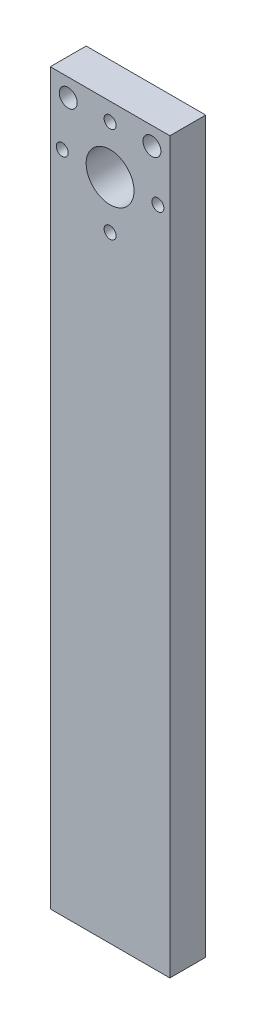
ISO-10303-21;
HEADER;
FILE_DESCRIPTION(('STEP AP214'),'2;1');
FILE_NAME('part.step','',(''),(''),'','','');
FILE_SCHEMA(('AUTOMOTIVE_DESIGN { 1 0 10303 214 1 1 1 1 }'));
ENDSEC;
DATA;
#1=APPLICATION_CONTEXT('core data for automotive mechanical design processes');
#2=APPLICATION_PROTOCOL_DEFINITION('international standard','automotive_design',2000,#1);
#3=PRODUCT_CONTEXT('',#1,'mechanical');
#4=PRODUCT('Part','Part','',(#3));
#5=PRODUCT_RELATED_PRODUCT_CATEGORY('part','',(#4));
#6=PRODUCT_DEFINITION_FORMATION('','',#4);
#7=PRODUCT_DEFINITION_CONTEXT('part definition',#1,'design');
#8=PRODUCT_DEFINITION('design','',#6,#7);
#9=PRODUCT_DEFINITION_SHAPE('','',#8);
#10=(LENGTH_UNIT() NAMED_UNIT(*) SI_UNIT(.MILLI.,.METRE.));
#11=(NAMED_UNIT(*) PLANE_ANGLE_UNIT() SI_UNIT($,.RADIAN.));
#12=(NAMED_UNIT(*) SI_UNIT($,.STERADIAN.) SOLID_ANGLE_UNIT());
#13=UNCERTAINTY_MEASURE_WITH_UNIT(LENGTH_MEASURE(1.E-05),#10,'distance_accuracy_value','');
#14=(GEOMETRIC_REPRESENTATION_CONTEXT(3) GLOBAL_UNCERTAINTY_ASSIGNED_CONTEXT((#13)) GLOBAL_UNIT_ASSIGNED_CONTEXT((#10,
#11,#12)) REPRESENTATION_CONTEXT('',''));
#15=CARTESIAN_POINT('',(0.,0.,0.));
#16=DIRECTION('',(0.,0.,1.));
#17=DIRECTION('',(1.,0.,0.));
#18=AXIS2_PLACEMENT_3D('',#15,#16,#17);
#19=CARTESIAN_POINT('',(-10.,84.,6.));
#20=DIRECTION('',(1.,0.,0.));
#21=DIRECTION('',(0.,1.,0.));
#22=AXIS2_PLACEMENT_3D('',#19,#20,#21);
#23=PLANE('',#22);
#24=DIRECTION('',(0.,-1.,0.));
#25=VECTOR('',#24,1.);
#26=CARTESIAN_POINT('',(-10.,84.,0.));
#27=LINE('',#26,#25);
#28=CARTESIAN_POINT('',(-10.,84.,0.));
#29=VERTEX_POINT('',#28);
#30=CARTESIAN_POINT('',(-9.99999999999999,-38.,0.));
#31=VERTEX_POINT('',#30);
#32=EDGE_CURVE('E95',#29,#31,#27,.T.);
#33=ORIENTED_EDGE('',*,*,#32,.T.);
#34=DIRECTION('',(0.,0.,-1.));
#35=VECTOR('',#34,1.);
#36=CARTESIAN_POINT('',(-9.99999999999999,-38.,6.));
#37=LINE('',#36,#35);
#38=CARTESIAN_POINT('',(-9.99999999999999,-38.,6.));
#39=VERTEX_POINT('',#38);
#40=EDGE_CURVE('E11',#39,#31,#37,.T.);
#41=ORIENTED_EDGE('',*,*,#40,.F.);
#42=DIRECTION('',(0.,-1.,0.));
#43=VECTOR('',#42,1.);
#44=CARTESIAN_POINT('',(-10.,84.,6.));
#45=LINE('',#44,#43);
#46=CARTESIAN_POINT('',(-10.,84.,6.));
#47=VERTEX_POINT('',#46);
#48=EDGE_CURVE('E83',#47,#39,#45,.T.);
#49=ORIENTED_EDGE('',*,*,#48,.F.);
#50=DIRECTION('',(0.,0.,-1.));
#51=VECTOR('',#50,1.);
#52=CARTESIAN_POINT('',(-10.,84.,6.));
#53=LINE('',#52,#51);
#54=EDGE_CURVE('E91',#47,#29,#53,.T.);
#55=ORIENTED_EDGE('',*,*,#54,.T.);
#56=EDGE_LOOP('',(#33,#41,#49,#55));
#57=FACE_BOUND('',#56,.T.);
#58=ADVANCED_FACE('F32',(#57),#23,.F.);
#59=CARTESIAN_POINT('',(-9.99999999999999,-38.,6.));
#60=DIRECTION('',(0.,1.,0.));
#61=DIRECTION('',(-1.,0.,0.));
#62=AXIS2_PLACEMENT_3D('',#59,#60,#61);
#63=PLANE('',#62);
#64=DIRECTION('',(1.,0.,0.));
#65=VECTOR('',#64,1.);
#66=CARTESIAN_POINT('',(-9.99999999999999,-38.,0.));
#67=LINE('',#66,#65);
#68=CARTESIAN_POINT('',(10.,-38.,0.));
#69=VERTEX_POINT('',#68);
#70=EDGE_CURVE('E87',#31,#69,#67,.T.);
#71=ORIENTED_EDGE('',*,*,#70,.T.);
#72=DIRECTION('',(0.,0.,-1.));
#73=VECTOR('',#72,1.);
#74=CARTESIAN_POINT('',(10.,-38.,6.));
#75=LINE('',#74,#73);
#76=CARTESIAN_POINT('',(10.,-38.,6.));
#77=VERTEX_POINT('',#76);
#78=EDGE_CURVE('E40',#77,#69,#75,.T.);
#79=ORIENTED_EDGE('',*,*,#78,.F.);
#80=DIRECTION('',(1.,0.,0.));
#81=VECTOR('',#80,1.);
#82=CARTESIAN_POINT('',(-9.99999999999999,-38.,6.));
#83=LINE('',#82,#81);
#84=EDGE_CURVE('E78',#39,#77,#83,.T.);
#85=ORIENTED_EDGE('',*,*,#84,.F.);
#86=ORIENTED_EDGE('',*,*,#40,.T.);
#87=EDGE_LOOP('',(#71,#79,#85,#86));
#88=FACE_BOUND('',#87,.T.);
#89=ADVANCED_FACE('F86',(#88),#63,.F.);
#90=CARTESIAN_POINT('',(9.99999999999999,84.,6.));
#91=DIRECTION('',(-1.,0.,0.));
#92=DIRECTION('',(0.,-1.,0.));
#93=AXIS2_PLACEMENT_3D('',#90,#91,#92);
#94=PLANE('',#93);
#95=DIRECTION('',(0.,1.,0.));
#96=VECTOR('',#95,1.);
#97=CARTESIAN_POINT('',(9.99999999999999,84.,0.));
#98=LINE('',#97,#96);
#99=CARTESIAN_POINT('',(9.99999999999999,84.,0.));
#100=VERTEX_POINT('',#99);
#101=EDGE_CURVE('E65',#69,#100,#98,.T.);
#102=ORIENTED_EDGE('',*,*,#101,.T.);
#103=DIRECTION('',(0.,0.,-1.));
#104=VECTOR('',#103,1.);
#105=CARTESIAN_POINT('',(9.99999999999999,84.,6.));
#106=LINE('',#105,#104);
#107=CARTESIAN_POINT('',(9.99999999999999,84.,6.));
#108=VERTEX_POINT('',#107);
#109=EDGE_CURVE('E88',#108,#100,#106,.T.);
#110=ORIENTED_EDGE('',*,*,#109,.F.);
#111=DIRECTION('',(0.,1.,0.));
#112=VECTOR('',#111,1.);
#113=CARTESIAN_POINT('',(9.99999999999999,84.,6.));
#114=LINE('',#113,#112);
#115=EDGE_CURVE('E81',#77,#108,#114,.T.);
#116=ORIENTED_EDGE('',*,*,#115,.F.);
#117=ORIENTED_EDGE('',*,*,#78,.T.);
#118=EDGE_LOOP('',(#102,#110,#116,#117));
#119=FACE_BOUND('',#118,.T.);
#120=ADVANCED_FACE('F89',(#119),#94,.F.);
#121=CARTESIAN_POINT('',(-10.,84.,6.));
#122=DIRECTION('',(0.,-1.,0.));
#123=DIRECTION('',(0.,0.,-1.));
#124=AXIS2_PLACEMENT_3D('',#121,#122,#123);
#125=PLANE('',#124);
#126=DIRECTION('',(-1.,0.,0.));
#127=VECTOR('',#126,1.);
#128=CARTESIAN_POINT('',(-10.,84.,0.));
#129=LINE('',#128,#127);
#130=EDGE_CURVE('E71',#100,#29,#129,.T.);
#131=ORIENTED_EDGE('',*,*,#130,.T.);
#132=ORIENTED_EDGE('',*,*,#54,.F.);
#133=DIRECTION('',(-1.,0.,0.));
#134=VECTOR('',#133,1.);
#135=CARTESIAN_POINT('',(-10.,84.,6.));
#136=LINE('',#135,#134);
#137=EDGE_CURVE('E48',#108,#47,#136,.T.);
#138=ORIENTED_EDGE('',*,*,#137,.F.);
#139=ORIENTED_EDGE('',*,*,#109,.T.);
#140=EDGE_LOOP('',(#131,#132,#138,#139));
#141=FACE_BOUND('',#140,.T.);
#142=ADVANCED_FACE('F103',(#141),#125,.F.);
#143=CARTESIAN_POINT('',(0.,0.,6.));
#144=DIRECTION('',(0.,0.,1.));
#145=DIRECTION('',(1.,0.,0.));
#146=AXIS2_PLACEMENT_3D('',#143,#144,#145);
#147=PLANE('',#146);
#148=CARTESIAN_POINT('',(7.00000000000001,81.,6.));
#149=DIRECTION('',(0.,0.,1.));
#150=DIRECTION('',(1.,0.,0.));
#151=AXIS2_PLACEMENT_3D('',#148,#149,#150);
#152=CIRCLE('',#151,1.5);
#153=CARTESIAN_POINT('',(8.50000000000001,81.,6.));
#154=VERTEX_POINT('',#153);
#155=EDGE_CURVE('E145',#154,#154,#152,.T.);
#156=ORIENTED_EDGE('',*,*,#155,.F.);
#157=EDGE_LOOP('',(#156));
#158=FACE_BOUND('',#157,.T.);
#159=CARTESIAN_POINT('',(-7.00000000000001,81.,6.));
#160=DIRECTION('',(0.,0.,1.));
#161=DIRECTION('',(1.,0.,0.));
#162=AXIS2_PLACEMENT_3D('',#159,#160,#161);
#163=CIRCLE('',#162,1.5);
#164=CARTESIAN_POINT('',(-5.50000000000001,81.,6.));
#165=VERTEX_POINT('',#164);
#166=EDGE_CURVE('E139',#165,#165,#163,.T.);
#167=ORIENTED_EDGE('',*,*,#166,.F.);
#168=EDGE_LOOP('',(#167));
#169=FACE_BOUND('',#168,.T.);
#170=CARTESIAN_POINT('',(8.,73.,6.));
#171=DIRECTION('',(0.,0.,1.));
#172=DIRECTION('',(1.,0.,0.));
#173=AXIS2_PLACEMENT_3D('',#170,#171,#172);
#174=CIRCLE('',#173,1.);
#175=CARTESIAN_POINT('',(9.,73.,6.));
#176=VERTEX_POINT('',#175);
#177=EDGE_CURVE('E133',#176,#176,#174,.T.);
#178=ORIENTED_EDGE('',*,*,#177,.F.);
#179=EDGE_LOOP('',(#178));
#180=FACE_BOUND('',#179,.T.);
#181=CARTESIAN_POINT('',(0.,65.,6.));
#182=DIRECTION('',(0.,0.,1.));
#183=DIRECTION('',(1.,0.,0.));
#184=AXIS2_PLACEMENT_3D('',#181,#182,#183);
#185=CIRCLE('',#184,1.);
#186=CARTESIAN_POINT('',(1.,65.,6.));
#187=VERTEX_POINT('',#186);
#188=EDGE_CURVE('E127',#187,#187,#185,.T.);
#189=ORIENTED_EDGE('',*,*,#188,.F.);
#190=EDGE_LOOP('',(#189));
#191=FACE_BOUND('',#190,.T.);
#192=CARTESIAN_POINT('',(-8.,73.,6.));
#193=DIRECTION('',(0.,0.,1.));
#194=DIRECTION('',(1.,0.,0.));
#195=AXIS2_PLACEMENT_3D('',#192,#193,#194);
#196=CIRCLE('',#195,1.);
#197=CARTESIAN_POINT('',(-7.,73.,6.));
#198=VERTEX_POINT('',#197);
#199=EDGE_CURVE('E121',#198,#198,#196,.T.);
#200=ORIENTED_EDGE('',*,*,#199,.F.);
#201=EDGE_LOOP('',(#200));
#202=FACE_BOUND('',#201,.T.);
#203=CARTESIAN_POINT('',(0.,81.,6.));
#204=DIRECTION('',(0.,0.,1.));
#205=DIRECTION('',(1.,0.,0.));
#206=AXIS2_PLACEMENT_3D('',#203,#204,#205);
#207=CIRCLE('',#206,1.);
#208=CARTESIAN_POINT('',(1.,81.,6.));
#209=VERTEX_POINT('',#208);
#210=EDGE_CURVE('E115',#209,#209,#207,.T.);
#211=ORIENTED_EDGE('',*,*,#210,.F.);
#212=EDGE_LOOP('',(#211));
#213=FACE_BOUND('',#212,.T.);
#214=CARTESIAN_POINT('',(0.,73.,6.));
#215=DIRECTION('',(0.,0.,1.));
#216=DIRECTION('',(1.,0.,0.));
#217=AXIS2_PLACEMENT_3D('',#214,#215,#216);
#218=CIRCLE('',#217,4.);
#219=CARTESIAN_POINT('',(4.,73.,6.));
#220=VERTEX_POINT('',#219);
#221=EDGE_CURVE('E109',#220,#220,#218,.T.);
#222=ORIENTED_EDGE('',*,*,#221,.F.);
#223=EDGE_LOOP('',(#222));
#224=FACE_BOUND('',#223,.T.);
#225=ORIENTED_EDGE('',*,*,#48,.T.);
#226=ORIENTED_EDGE('',*,*,#84,.T.);
#227=ORIENTED_EDGE('',*,*,#115,.T.);
#228=ORIENTED_EDGE('',*,*,#137,.T.);
#229=EDGE_LOOP('',(#225,#226,#227,#228));
#230=FACE_BOUND('',#229,.T.);
#231=ADVANCED_FACE('F79',(#158,#169,#180,#191,#202,#213,#224,#230),#147,.T.);
#232=CARTESIAN_POINT('',(0.,0.,0.));
#233=DIRECTION('',(0.,0.,1.));
#234=DIRECTION('',(1.,0.,0.));
#235=AXIS2_PLACEMENT_3D('',#232,#233,#234);
#236=PLANE('',#235);
#237=CARTESIAN_POINT('',(7.00000000000001,81.,0.));
#238=DIRECTION('',(0.,0.,1.));
#239=DIRECTION('',(1.,0.,0.));
#240=AXIS2_PLACEMENT_3D('',#237,#238,#239);
#241=CIRCLE('',#240,1.5);
#242=CARTESIAN_POINT('',(8.50000000000001,81.,0.));
#243=VERTEX_POINT('',#242);
#244=EDGE_CURVE('E142',#243,#243,#241,.T.);
#245=ORIENTED_EDGE('',*,*,#244,.T.);
#246=EDGE_LOOP('',(#245));
#247=FACE_BOUND('',#246,.T.);
#248=CARTESIAN_POINT('',(-7.00000000000001,81.,0.));
#249=DIRECTION('',(0.,0.,1.));
#250=DIRECTION('',(1.,0.,0.));
#251=AXIS2_PLACEMENT_3D('',#248,#249,#250);
#252=CIRCLE('',#251,1.5);
#253=CARTESIAN_POINT('',(-5.50000000000001,81.,0.));
#254=VERTEX_POINT('',#253);
#255=EDGE_CURVE('E136',#254,#254,#252,.T.);
#256=ORIENTED_EDGE('',*,*,#255,.T.);
#257=EDGE_LOOP('',(#256));
#258=FACE_BOUND('',#257,.T.);
#259=CARTESIAN_POINT('',(8.,73.,0.));
#260=DIRECTION('',(0.,0.,1.));
#261=DIRECTION('',(1.,0.,0.));
#262=AXIS2_PLACEMENT_3D('',#259,#260,#261);
#263=CIRCLE('',#262,1.);
#264=CARTESIAN_POINT('',(9.,73.,0.));
#265=VERTEX_POINT('',#264);
#266=EDGE_CURVE('E130',#265,#265,#263,.T.);
#267=ORIENTED_EDGE('',*,*,#266,.T.);
#268=EDGE_LOOP('',(#267));
#269=FACE_BOUND('',#268,.T.);
#270=CARTESIAN_POINT('',(0.,65.,0.));
#271=DIRECTION('',(0.,0.,1.));
#272=DIRECTION('',(1.,0.,0.));
#273=AXIS2_PLACEMENT_3D('',#270,#271,#272);
#274=CIRCLE('',#273,1.);
#275=CARTESIAN_POINT('',(1.,65.,0.));
#276=VERTEX_POINT('',#275);
#277=EDGE_CURVE('E124',#276,#276,#274,.T.);
#278=ORIENTED_EDGE('',*,*,#277,.T.);
#279=EDGE_LOOP('',(#278));
#280=FACE_BOUND('',#279,.T.);
#281=CARTESIAN_POINT('',(-8.,73.,0.));
#282=DIRECTION('',(0.,0.,1.));
#283=DIRECTION('',(1.,0.,0.));
#284=AXIS2_PLACEMENT_3D('',#281,#282,#283);
#285=CIRCLE('',#284,1.);
#286=CARTESIAN_POINT('',(-7.,73.,0.));
#287=VERTEX_POINT('',#286);
#288=EDGE_CURVE('E118',#287,#287,#285,.T.);
#289=ORIENTED_EDGE('',*,*,#288,.T.);
#290=EDGE_LOOP('',(#289));
#291=FACE_BOUND('',#290,.T.);
#292=CARTESIAN_POINT('',(0.,81.,0.));
#293=DIRECTION('',(0.,0.,1.));
#294=DIRECTION('',(1.,0.,0.));
#295=AXIS2_PLACEMENT_3D('',#292,#293,#294);
#296=CIRCLE('',#295,1.);
#297=CARTESIAN_POINT('',(1.,81.,0.));
#298=VERTEX_POINT('',#297);
#299=EDGE_CURVE('E112',#298,#298,#296,.T.);
#300=ORIENTED_EDGE('',*,*,#299,.T.);
#301=EDGE_LOOP('',(#300));
#302=FACE_BOUND('',#301,.T.);
#303=CARTESIAN_POINT('',(0.,73.,0.));
#304=DIRECTION('',(0.,0.,1.));
#305=DIRECTION('',(1.,0.,0.));
#306=AXIS2_PLACEMENT_3D('',#303,#304,#305);
#307=CIRCLE('',#306,4.);
#308=CARTESIAN_POINT('',(4.,73.,0.));
#309=VERTEX_POINT('',#308);
#310=EDGE_CURVE('E98',#309,#309,#307,.T.);
#311=ORIENTED_EDGE('',*,*,#310,.T.);
#312=EDGE_LOOP('',(#311));
#313=FACE_BOUND('',#312,.T.);
#314=ORIENTED_EDGE('',*,*,#32,.F.);
#315=ORIENTED_EDGE('',*,*,#130,.F.);
#316=ORIENTED_EDGE('',*,*,#101,.F.);
#317=ORIENTED_EDGE('',*,*,#70,.F.);
#318=EDGE_LOOP('',(#314,#315,#316,#317));
#319=FACE_BOUND('',#318,.T.);
#320=ADVANCED_FACE('F106',(#247,#258,#269,#280,#291,#302,#313,#319),#236,.F.);
#321=CARTESIAN_POINT('',(0.,73.,0.));
#322=DIRECTION('',(0.,0.,1.));
#323=DIRECTION('',(1.,0.,0.));
#324=AXIS2_PLACEMENT_3D('',#321,#322,#323);
#325=CYLINDRICAL_SURFACE('',#324,4.);
#326=ORIENTED_EDGE('',*,*,#310,.F.);
#327=EDGE_LOOP('',(#326));
#328=FACE_BOUND('',#327,.T.);
#329=ORIENTED_EDGE('',*,*,#221,.T.);
#330=EDGE_LOOP('',(#329));
#331=FACE_BOUND('',#330,.T.);
#332=ADVANCED_FACE('F175',(#328,#331),#325,.F.);
#333=CARTESIAN_POINT('',(0.,81.,0.));
#334=DIRECTION('',(0.,0.,1.));
#335=DIRECTION('',(1.,0.,0.));
#336=AXIS2_PLACEMENT_3D('',#333,#334,#335);
#337=CYLINDRICAL_SURFACE('',#336,1.);
#338=ORIENTED_EDGE('',*,*,#299,.F.);
#339=EDGE_LOOP('',(#338));
#340=FACE_BOUND('',#339,.T.);
#341=ORIENTED_EDGE('',*,*,#210,.T.);
#342=EDGE_LOOP('',(#341));
#343=FACE_BOUND('',#342,.T.);
#344=ADVANCED_FACE('F177',(#340,#343),#337,.F.);
#345=CARTESIAN_POINT('',(-8.,73.,0.));
#346=DIRECTION('',(0.,0.,1.));
#347=DIRECTION('',(1.,0.,0.));
#348=AXIS2_PLACEMENT_3D('',#345,#346,#347);
#349=CYLINDRICAL_SURFACE('',#348,1.);
#350=ORIENTED_EDGE('',*,*,#288,.F.);
#351=EDGE_LOOP('',(#350));
#352=FACE_BOUND('',#351,.T.);
#353=ORIENTED_EDGE('',*,*,#199,.T.);
#354=EDGE_LOOP('',(#353));
#355=FACE_BOUND('',#354,.T.);
#356=ADVANCED_FACE('F184',(#352,#355),#349,.F.);
#357=CARTESIAN_POINT('',(0.,65.,0.));
#358=DIRECTION('',(0.,0.,1.));
#359=DIRECTION('',(1.,0.,0.));
#360=AXIS2_PLACEMENT_3D('',#357,#358,#359);
#361=CYLINDRICAL_SURFACE('',#360,1.);
#362=ORIENTED_EDGE('',*,*,#277,.F.);
#363=EDGE_LOOP('',(#362));
#364=FACE_BOUND('',#363,.T.);
#365=ORIENTED_EDGE('',*,*,#188,.T.);
#366=EDGE_LOOP('',(#365));
#367=FACE_BOUND('',#366,.T.);
#368=ADVANCED_FACE('F230',(#364,#367),#361,.F.);
#369=CARTESIAN_POINT('',(8.,73.,0.));
#370=DIRECTION('',(0.,0.,1.));
#371=DIRECTION('',(1.,0.,0.));
#372=AXIS2_PLACEMENT_3D('',#369,#370,#371);
#373=CYLINDRICAL_SURFACE('',#372,1.);
#374=ORIENTED_EDGE('',*,*,#266,.F.);
#375=EDGE_LOOP('',(#374));
#376=FACE_BOUND('',#375,.T.);
#377=ORIENTED_EDGE('',*,*,#177,.T.);
#378=EDGE_LOOP('',(#377));
#379=FACE_BOUND('',#378,.T.);
#380=ADVANCED_FACE('F240',(#376,#379),#373,.F.);
#381=CARTESIAN_POINT('',(-7.00000000000001,81.,0.));
#382=DIRECTION('',(0.,0.,1.));
#383=DIRECTION('',(1.,0.,0.));
#384=AXIS2_PLACEMENT_3D('',#381,#382,#383);
#385=CYLINDRICAL_SURFACE('',#384,1.5);
#386=ORIENTED_EDGE('',*,*,#255,.F.);
#387=EDGE_LOOP('',(#386));
#388=FACE_BOUND('',#387,.T.);
#389=ORIENTED_EDGE('',*,*,#166,.T.);
#390=EDGE_LOOP('',(#389));
#391=FACE_BOUND('',#390,.T.);
#392=ADVANCED_FACE('F156',(#388,#391),#385,.F.);
#393=CARTESIAN_POINT('',(7.00000000000001,81.,0.));
#394=DIRECTION('',(0.,0.,1.));
#395=DIRECTION('',(1.,0.,0.));
#396=AXIS2_PLACEMENT_3D('',#393,#394,#395);
#397=CYLINDRICAL_SURFACE('',#396,1.5);
#398=ORIENTED_EDGE('',*,*,#244,.F.);
#399=EDGE_LOOP('',(#398));
#400=FACE_BOUND('',#399,.T.);
#401=ORIENTED_EDGE('',*,*,#155,.T.);
#402=EDGE_LOOP('',(#401));
#403=FACE_BOUND('',#402,.T.);
#404=ADVANCED_FACE('F153',(#400,#403),#397,.F.);
#405=CLOSED_SHELL('',(#58,#89,#120,#142,#231,#320,#332,#344,#356,#368,#380,#392,#404));
#406=MANIFOLD_SOLID_BREP('B2',#405);
#407=ADVANCED_BREP_SHAPE_REPRESENTATION('',(#18,#406),#14);
#408=SHAPE_DEFINITION_REPRESENTATION(#9,#407);
ENDSEC;
END-ISO-10303-21;
